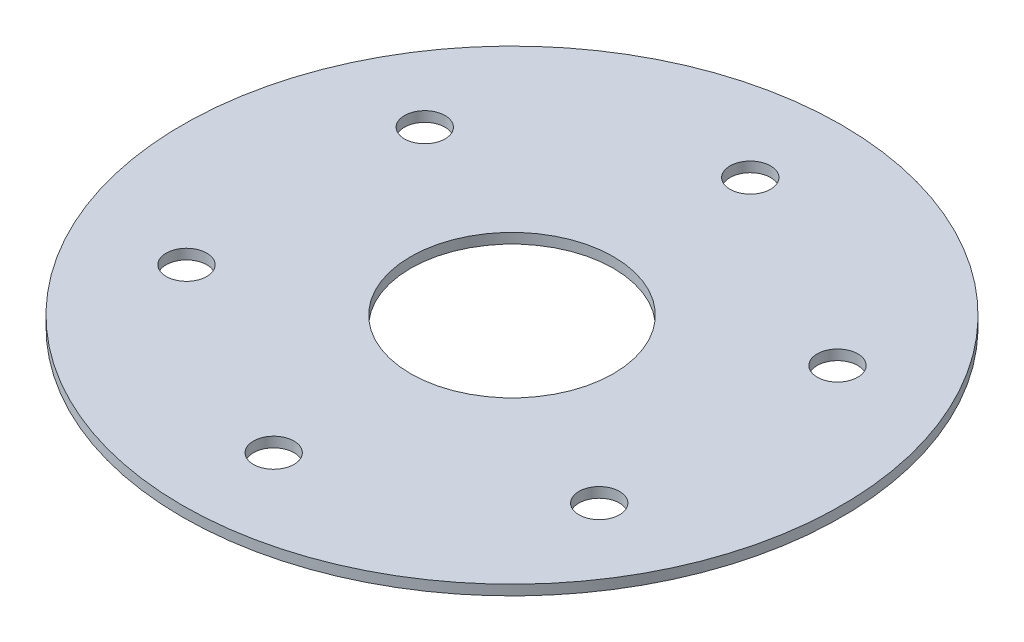
ISO-10303-21;
HEADER;
FILE_DESCRIPTION(('STEP AP214'),'2;1');
FILE_NAME('part.step','',(''),(''),'','','');
FILE_SCHEMA(('AUTOMOTIVE_DESIGN { 1 0 10303 214 1 1 1 1 }'));
ENDSEC;
DATA;
#1=APPLICATION_CONTEXT('core data for automotive mechanical design processes');
#2=APPLICATION_PROTOCOL_DEFINITION('international standard','automotive_design',2000,#1);
#3=PRODUCT_CONTEXT('',#1,'mechanical');
#4=PRODUCT('Part','Part','',(#3));
#5=PRODUCT_RELATED_PRODUCT_CATEGORY('part','',(#4));
#6=PRODUCT_DEFINITION_FORMATION('','',#4);
#7=PRODUCT_DEFINITION_CONTEXT('part definition',#1,'design');
#8=PRODUCT_DEFINITION('design','',#6,#7);
#9=PRODUCT_DEFINITION_SHAPE('','',#8);
#10=(LENGTH_UNIT() NAMED_UNIT(*) SI_UNIT(.MILLI.,.METRE.));
#11=(NAMED_UNIT(*) PLANE_ANGLE_UNIT() SI_UNIT($,.RADIAN.));
#12=(NAMED_UNIT(*) SI_UNIT($,.STERADIAN.) SOLID_ANGLE_UNIT());
#13=UNCERTAINTY_MEASURE_WITH_UNIT(LENGTH_MEASURE(1.E-05),#10,'distance_accuracy_value','');
#14=(GEOMETRIC_REPRESENTATION_CONTEXT(3) GLOBAL_UNCERTAINTY_ASSIGNED_CONTEXT((#13)) GLOBAL_UNIT_ASSIGNED_CONTEXT((#10,
#11,#12)) REPRESENTATION_CONTEXT('',''));
#15=CARTESIAN_POINT('',(0.,0.,0.));
#16=DIRECTION('',(0.,0.,1.));
#17=DIRECTION('',(1.,0.,0.));
#18=AXIS2_PLACEMENT_3D('',#15,#16,#17);
#19=CARTESIAN_POINT('',(0.,1.,0.));
#20=DIRECTION('',(0.,1.,0.));
#21=DIRECTION('',(0.,0.,1.));
#22=AXIS2_PLACEMENT_3D('',#19,#20,#21);
#23=PLANE('',#22);
#24=CARTESIAN_POINT('',(-20.3515969889328,1.,11.7500000000009));
#25=DIRECTION('',(0.,1.,0.));
#26=DIRECTION('',(0.,0.,1.));
#27=AXIS2_PLACEMENT_3D('',#24,#25,#26);
#28=CIRCLE('',#27,2.0000000000019);
#29=CARTESIAN_POINT('',(-20.3515969889328,1.,13.7500000000028));
#30=VERTEX_POINT('',#29);
#31=EDGE_CURVE('E71',#30,#30,#28,.T.);
#32=ORIENTED_EDGE('',*,*,#31,.F.);
#33=EDGE_LOOP('',(#32));
#34=FACE_BOUND('',#33,.T.);
#35=CARTESIAN_POINT('',(20.3515969889358,1.,11.7499999999991));
#36=DIRECTION('',(0.,1.,0.));
#37=DIRECTION('',(0.,0.,1.));
#38=AXIS2_PLACEMENT_3D('',#35,#36,#37);
#39=CIRCLE('',#38,2.00000000000129);
#40=CARTESIAN_POINT('',(20.3515969889358,1.,13.7500000000004));
#41=VERTEX_POINT('',#40);
#42=EDGE_CURVE('E59',#41,#41,#39,.T.);
#43=ORIENTED_EDGE('',*,*,#42,.F.);
#44=EDGE_LOOP('',(#43));
#45=FACE_BOUND('',#44,.T.);
#46=CARTESIAN_POINT('',(0.,1.,-23.5));
#47=DIRECTION('',(0.,1.,0.));
#48=DIRECTION('',(0.,0.,1.));
#49=AXIS2_PLACEMENT_3D('',#46,#47,#48);
#50=CIRCLE('',#49,2.);
#51=CARTESIAN_POINT('',(0.,1.,-21.5));
#52=VERTEX_POINT('',#51);
#53=EDGE_CURVE('E47',#52,#52,#50,.T.);
#54=ORIENTED_EDGE('',*,*,#53,.F.);
#55=EDGE_LOOP('',(#54));
#56=FACE_BOUND('',#55,.T.);
#57=CARTESIAN_POINT('',(0.,1.,0.));
#58=DIRECTION('',(0.,1.,0.));
#59=DIRECTION('',(0.,0.,1.));
#60=AXIS2_PLACEMENT_3D('',#57,#58,#59);
#61=CIRCLE('',#60,32.5);
#62=CARTESIAN_POINT('',(0.,1.,32.5));
#63=VERTEX_POINT('',#62);
#64=EDGE_CURVE('E10',#63,#63,#61,.T.);
#65=ORIENTED_EDGE('',*,*,#64,.T.);
#66=EDGE_LOOP('',(#65));
#67=FACE_BOUND('',#66,.T.);
#68=CARTESIAN_POINT('',(0.,1.,0.));
#69=DIRECTION('',(0.,1.,0.));
#70=DIRECTION('',(0.,0.,1.));
#71=AXIS2_PLACEMENT_3D('',#68,#69,#70);
#72=CIRCLE('',#71,10.);
#73=CARTESIAN_POINT('',(0.,1.,10.));
#74=VERTEX_POINT('',#73);
#75=EDGE_CURVE('E42',#74,#74,#72,.T.);
#76=ORIENTED_EDGE('',*,*,#75,.F.);
#77=EDGE_LOOP('',(#76));
#78=FACE_BOUND('',#77,.T.);
#79=CARTESIAN_POINT('',(20.3515969889348,1.,-11.7500000000009));
#80=DIRECTION('',(0.,1.,0.));
#81=DIRECTION('',(0.,0.,1.));
#82=AXIS2_PLACEMENT_3D('',#79,#80,#81);
#83=CIRCLE('',#82,2.00000000000028);
#84=CARTESIAN_POINT('',(20.3515969889348,1.,-9.75000000000059));
#85=VERTEX_POINT('',#84);
#86=EDGE_CURVE('E53',#85,#85,#83,.T.);
#87=ORIENTED_EDGE('',*,*,#86,.F.);
#88=EDGE_LOOP('',(#87));
#89=FACE_BOUND('',#88,.T.);
#90=CARTESIAN_POINT('',(1.99797467488749E-12,1.,23.5));
#91=DIRECTION('',(0.,1.,0.));
#92=DIRECTION('',(0.,0.,1.));
#93=AXIS2_PLACEMENT_3D('',#90,#91,#92);
#94=CIRCLE('',#93,2.00000000000207);
#95=CARTESIAN_POINT('',(1.99797467488749E-12,1.,25.5000000000021));
#96=VERTEX_POINT('',#95);
#97=EDGE_CURVE('E65',#96,#96,#94,.T.);
#98=ORIENTED_EDGE('',*,*,#97,.F.);
#99=EDGE_LOOP('',(#98));
#100=FACE_BOUND('',#99,.T.);
#101=CARTESIAN_POINT('',(-20.3515969889338,1.,-11.7499999999991));
#102=DIRECTION('',(0.,1.,0.));
#103=DIRECTION('',(0.,0.,1.));
#104=AXIS2_PLACEMENT_3D('',#101,#102,#103);
#105=CIRCLE('',#104,2.00000000000101);
#106=CARTESIAN_POINT('',(-20.3515969889338,1.,-9.74999999999811));
#107=VERTEX_POINT('',#106);
#108=EDGE_CURVE('E77',#107,#107,#105,.T.);
#109=ORIENTED_EDGE('',*,*,#108,.F.);
#110=EDGE_LOOP('',(#109));
#111=FACE_BOUND('',#110,.T.);
#112=ADVANCED_FACE('F31',(#34,#45,#56,#67,#78,#89,#100,#111),#23,.T.);
#113=CARTESIAN_POINT('',(0.,0.,0.));
#114=DIRECTION('',(0.,1.,0.));
#115=DIRECTION('',(0.,0.,1.));
#116=AXIS2_PLACEMENT_3D('',#113,#114,#115);
#117=PLANE('',#116);
#118=CARTESIAN_POINT('',(0.,0.,0.));
#119=DIRECTION('',(0.,1.,0.));
#120=DIRECTION('',(0.,0.,1.));
#121=AXIS2_PLACEMENT_3D('',#118,#119,#120);
#122=CIRCLE('',#121,32.5);
#123=CARTESIAN_POINT('',(0.,0.,32.5));
#124=VERTEX_POINT('',#123);
#125=EDGE_CURVE('E35',#124,#124,#122,.T.);
#126=ORIENTED_EDGE('',*,*,#125,.F.);
#127=EDGE_LOOP('',(#126));
#128=FACE_BOUND('',#127,.T.);
#129=CARTESIAN_POINT('',(0.,0.,0.));
#130=DIRECTION('',(0.,1.,0.));
#131=DIRECTION('',(0.,0.,1.));
#132=AXIS2_PLACEMENT_3D('',#129,#130,#131);
#133=CIRCLE('',#132,10.);
#134=CARTESIAN_POINT('',(0.,0.,10.));
#135=VERTEX_POINT('',#134);
#136=EDGE_CURVE('E44',#135,#135,#133,.T.);
#137=ORIENTED_EDGE('',*,*,#136,.T.);
#138=EDGE_LOOP('',(#137));
#139=FACE_BOUND('',#138,.T.);
#140=CARTESIAN_POINT('',(0.,0.,-23.5));
#141=DIRECTION('',(0.,1.,0.));
#142=DIRECTION('',(0.,0.,1.));
#143=AXIS2_PLACEMENT_3D('',#140,#141,#142);
#144=CIRCLE('',#143,2.);
#145=CARTESIAN_POINT('',(0.,0.,-21.5));
#146=VERTEX_POINT('',#145);
#147=EDGE_CURVE('E50',#146,#146,#144,.T.);
#148=ORIENTED_EDGE('',*,*,#147,.T.);
#149=EDGE_LOOP('',(#148));
#150=FACE_BOUND('',#149,.T.);
#151=CARTESIAN_POINT('',(20.3515969889348,0.,-11.7500000000009));
#152=DIRECTION('',(0.,1.,0.));
#153=DIRECTION('',(0.,0.,1.));
#154=AXIS2_PLACEMENT_3D('',#151,#152,#153);
#155=CIRCLE('',#154,2.00000000000028);
#156=CARTESIAN_POINT('',(20.3515969889348,0.,-9.75000000000059));
#157=VERTEX_POINT('',#156);
#158=EDGE_CURVE('E56',#157,#157,#155,.T.);
#159=ORIENTED_EDGE('',*,*,#158,.T.);
#160=EDGE_LOOP('',(#159));
#161=FACE_BOUND('',#160,.T.);
#162=CARTESIAN_POINT('',(20.3515969889358,0.,11.7499999999991));
#163=DIRECTION('',(0.,1.,0.));
#164=DIRECTION('',(0.,0.,1.));
#165=AXIS2_PLACEMENT_3D('',#162,#163,#164);
#166=CIRCLE('',#165,2.00000000000129);
#167=CARTESIAN_POINT('',(20.3515969889358,0.,13.7500000000004));
#168=VERTEX_POINT('',#167);
#169=EDGE_CURVE('E62',#168,#168,#166,.T.);
#170=ORIENTED_EDGE('',*,*,#169,.T.);
#171=EDGE_LOOP('',(#170));
#172=FACE_BOUND('',#171,.T.);
#173=CARTESIAN_POINT('',(1.99797467488749E-12,0.,23.5));
#174=DIRECTION('',(0.,1.,0.));
#175=DIRECTION('',(0.,0.,1.));
#176=AXIS2_PLACEMENT_3D('',#173,#174,#175);
#177=CIRCLE('',#176,2.00000000000207);
#178=CARTESIAN_POINT('',(1.99797467488749E-12,0.,25.5000000000021));
#179=VERTEX_POINT('',#178);
#180=EDGE_CURVE('E68',#179,#179,#177,.T.);
#181=ORIENTED_EDGE('',*,*,#180,.T.);
#182=EDGE_LOOP('',(#181));
#183=FACE_BOUND('',#182,.T.);
#184=CARTESIAN_POINT('',(-20.3515969889328,0.,11.7500000000009));
#185=DIRECTION('',(0.,1.,0.));
#186=DIRECTION('',(0.,0.,1.));
#187=AXIS2_PLACEMENT_3D('',#184,#185,#186);
#188=CIRCLE('',#187,2.0000000000019);
#189=CARTESIAN_POINT('',(-20.3515969889328,0.,13.7500000000028));
#190=VERTEX_POINT('',#189);
#191=EDGE_CURVE('E74',#190,#190,#188,.T.);
#192=ORIENTED_EDGE('',*,*,#191,.T.);
#193=EDGE_LOOP('',(#192));
#194=FACE_BOUND('',#193,.T.);
#195=CARTESIAN_POINT('',(-20.3515969889338,0.,-11.7499999999991));
#196=DIRECTION('',(0.,1.,0.));
#197=DIRECTION('',(0.,0.,1.));
#198=AXIS2_PLACEMENT_3D('',#195,#196,#197);
#199=CIRCLE('',#198,2.00000000000101);
#200=CARTESIAN_POINT('',(-20.3515969889338,0.,-9.74999999999811));
#201=VERTEX_POINT('',#200);
#202=EDGE_CURVE('E80',#201,#201,#199,.T.);
#203=ORIENTED_EDGE('',*,*,#202,.T.);
#204=EDGE_LOOP('',(#203));
#205=FACE_BOUND('',#204,.T.);
#206=ADVANCED_FACE('F90',(#128,#139,#150,#161,#172,#183,#194,#205),#117,.F.);
#207=CARTESIAN_POINT('',(0.,1.,0.));
#208=DIRECTION('',(0.,-1.,0.));
#209=DIRECTION('',(0.,0.,-1.));
#210=AXIS2_PLACEMENT_3D('',#207,#208,#209);
#211=CYLINDRICAL_SURFACE('',#210,32.5);
#212=ORIENTED_EDGE('',*,*,#64,.F.);
#213=EDGE_LOOP('',(#212));
#214=FACE_BOUND('',#213,.T.);
#215=ORIENTED_EDGE('',*,*,#125,.T.);
#216=EDGE_LOOP('',(#215));
#217=FACE_BOUND('',#216,.T.);
#218=ADVANCED_FACE('F33',(#214,#217),#211,.T.);
#219=CARTESIAN_POINT('',(0.,1.,0.));
#220=DIRECTION('',(0.,-1.,0.));
#221=DIRECTION('',(0.,0.,-1.));
#222=AXIS2_PLACEMENT_3D('',#219,#220,#221);
#223=CYLINDRICAL_SURFACE('',#222,10.);
#224=ORIENTED_EDGE('',*,*,#75,.T.);
#225=EDGE_LOOP('',(#224));
#226=FACE_BOUND('',#225,.T.);
#227=ORIENTED_EDGE('',*,*,#136,.F.);
#228=EDGE_LOOP('',(#227));
#229=FACE_BOUND('',#228,.T.);
#230=ADVANCED_FACE('F100',(#226,#229),#223,.F.);
#231=CARTESIAN_POINT('',(0.,1.,-23.5));
#232=DIRECTION('',(0.,-1.,0.));
#233=DIRECTION('',(0.,0.,-1.));
#234=AXIS2_PLACEMENT_3D('',#231,#232,#233);
#235=CYLINDRICAL_SURFACE('',#234,2.);
#236=ORIENTED_EDGE('',*,*,#53,.T.);
#237=EDGE_LOOP('',(#236));
#238=FACE_BOUND('',#237,.T.);
#239=ORIENTED_EDGE('',*,*,#147,.F.);
#240=EDGE_LOOP('',(#239));
#241=FACE_BOUND('',#240,.T.);
#242=ADVANCED_FACE('F103',(#238,#241),#235,.F.);
#243=CARTESIAN_POINT('',(20.3515969889348,1.,-11.7500000000009));
#244=DIRECTION('',(0.,-1.,0.));
#245=DIRECTION('',(0.,0.,-1.));
#246=AXIS2_PLACEMENT_3D('',#243,#244,#245);
#247=CYLINDRICAL_SURFACE('',#246,2.00000000000028);
#248=ORIENTED_EDGE('',*,*,#86,.T.);
#249=EDGE_LOOP('',(#248));
#250=FACE_BOUND('',#249,.T.);
#251=ORIENTED_EDGE('',*,*,#158,.F.);
#252=EDGE_LOOP('',(#251));
#253=FACE_BOUND('',#252,.T.);
#254=ADVANCED_FACE('F107',(#250,#253),#247,.F.);
#255=CARTESIAN_POINT('',(20.3515969889358,1.,11.7499999999991));
#256=DIRECTION('',(0.,-1.,0.));
#257=DIRECTION('',(0.,0.,-1.));
#258=AXIS2_PLACEMENT_3D('',#255,#256,#257);
#259=CYLINDRICAL_SURFACE('',#258,2.00000000000129);
#260=ORIENTED_EDGE('',*,*,#42,.T.);
#261=EDGE_LOOP('',(#260));
#262=FACE_BOUND('',#261,.T.);
#263=ORIENTED_EDGE('',*,*,#169,.F.);
#264=EDGE_LOOP('',(#263));
#265=FACE_BOUND('',#264,.T.);
#266=ADVANCED_FACE('F111',(#262,#265),#259,.F.);
#267=CARTESIAN_POINT('',(1.99797467488749E-12,1.,23.5));
#268=DIRECTION('',(0.,-1.,0.));
#269=DIRECTION('',(0.,0.,-1.));
#270=AXIS2_PLACEMENT_3D('',#267,#268,#269);
#271=CYLINDRICAL_SURFACE('',#270,2.00000000000207);
#272=ORIENTED_EDGE('',*,*,#97,.T.);
#273=EDGE_LOOP('',(#272));
#274=FACE_BOUND('',#273,.T.);
#275=ORIENTED_EDGE('',*,*,#180,.F.);
#276=EDGE_LOOP('',(#275));
#277=FACE_BOUND('',#276,.T.);
#278=ADVANCED_FACE('F115',(#274,#277),#271,.F.);
#279=CARTESIAN_POINT('',(-20.3515969889328,1.,11.7500000000009));
#280=DIRECTION('',(0.,-1.,0.));
#281=DIRECTION('',(0.,0.,-1.));
#282=AXIS2_PLACEMENT_3D('',#279,#280,#281);
#283=CYLINDRICAL_SURFACE('',#282,2.0000000000019);
#284=ORIENTED_EDGE('',*,*,#31,.T.);
#285=EDGE_LOOP('',(#284));
#286=FACE_BOUND('',#285,.T.);
#287=ORIENTED_EDGE('',*,*,#191,.F.);
#288=EDGE_LOOP('',(#287));
#289=FACE_BOUND('',#288,.T.);
#290=ADVANCED_FACE('F119',(#286,#289),#283,.F.);
#291=CARTESIAN_POINT('',(-20.3515969889338,1.,-11.7499999999991));
#292=DIRECTION('',(0.,-1.,0.));
#293=DIRECTION('',(0.,0.,-1.));
#294=AXIS2_PLACEMENT_3D('',#291,#292,#293);
#295=CYLINDRICAL_SURFACE('',#294,2.00000000000101);
#296=ORIENTED_EDGE('',*,*,#108,.T.);
#297=EDGE_LOOP('',(#296));
#298=FACE_BOUND('',#297,.T.);
#299=ORIENTED_EDGE('',*,*,#202,.F.);
#300=EDGE_LOOP('',(#299));
#301=FACE_BOUND('',#300,.T.);
#302=ADVANCED_FACE('F86',(#298,#301),#295,.F.);
#303=CLOSED_SHELL('',(#112,#206,#218,#230,#242,#254,#266,#278,#290,#302));
#304=MANIFOLD_SOLID_BREP('B2',#303);
#305=ADVANCED_BREP_SHAPE_REPRESENTATION('',(#18,#304),#14);
#306=SHAPE_DEFINITION_REPRESENTATION(#9,#305);
ENDSEC;
END-ISO-10303-21;
